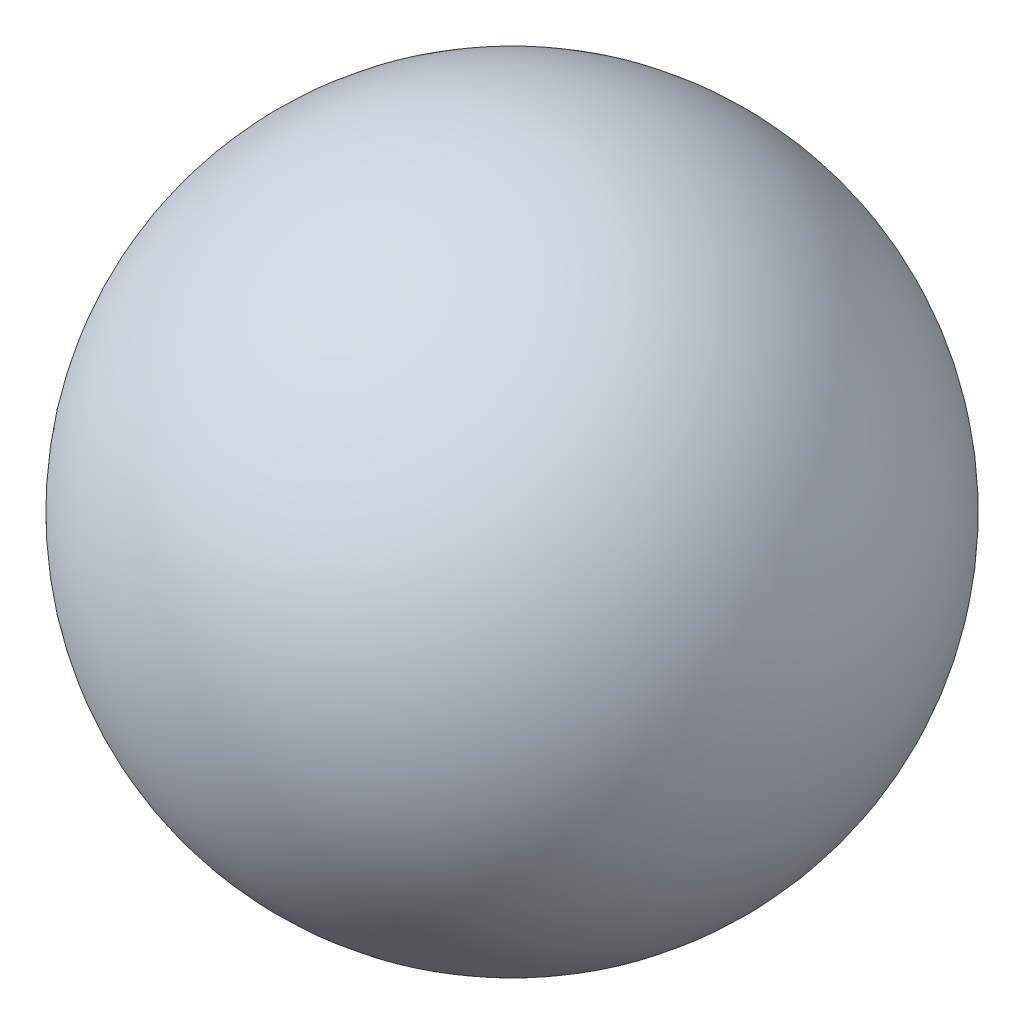
ISO-10303-21;
HEADER;
FILE_DESCRIPTION(('STEP AP214'),'2;1');
FILE_NAME('part.step','',(''),(''),'','','');
FILE_SCHEMA(('AUTOMOTIVE_DESIGN { 1 0 10303 214 1 1 1 1 }'));
ENDSEC;
DATA;
#1=APPLICATION_CONTEXT('core data for automotive mechanical design processes');
#2=APPLICATION_PROTOCOL_DEFINITION('international standard','automotive_design',2000,#1);
#3=PRODUCT_CONTEXT('',#1,'mechanical');
#4=PRODUCT('Part','Part','',(#3));
#5=PRODUCT_RELATED_PRODUCT_CATEGORY('part','',(#4));
#6=PRODUCT_DEFINITION_FORMATION('','',#4);
#7=PRODUCT_DEFINITION_CONTEXT('part definition',#1,'design');
#8=PRODUCT_DEFINITION('design','',#6,#7);
#9=PRODUCT_DEFINITION_SHAPE('','',#8);
#10=(LENGTH_UNIT() NAMED_UNIT(*) SI_UNIT(.MILLI.,.METRE.));
#11=(NAMED_UNIT(*) PLANE_ANGLE_UNIT() SI_UNIT($,.RADIAN.));
#12=(NAMED_UNIT(*) SI_UNIT($,.STERADIAN.) SOLID_ANGLE_UNIT());
#13=UNCERTAINTY_MEASURE_WITH_UNIT(LENGTH_MEASURE(1.E-05),#10,'distance_accuracy_value','');
#14=(GEOMETRIC_REPRESENTATION_CONTEXT(3) GLOBAL_UNCERTAINTY_ASSIGNED_CONTEXT((#13)) GLOBAL_UNIT_ASSIGNED_CONTEXT((#10,
#11,#12)) REPRESENTATION_CONTEXT('',''));
#15=CARTESIAN_POINT('',(0.,0.,0.));
#16=DIRECTION('',(0.,0.,1.));
#17=DIRECTION('',(1.,0.,0.));
#18=AXIS2_PLACEMENT_3D('',#15,#16,#17);
#19=CARTESIAN_POINT('',(0.,127.,0.));
#20=DIRECTION('',(0.,1.,0.));
#21=DIRECTION('',(1.,0.,0.));
#22=AXIS2_PLACEMENT_3D('',#19,#20,#21);
#23=SPHERICAL_SURFACE('',#22,127.);
#24=CARTESIAN_POINT('',(0.,254.,0.));
#25=VERTEX_POINT('',#24);
#26=VERTEX_LOOP('',#25);
#27=FACE_BOUND('',#26,.T.);
#28=ADVANCED_FACE('F29',(#27),#23,.T.);
#29=CLOSED_SHELL('',(#28));
#30=MANIFOLD_SOLID_BREP('B2',#29);
#31=ADVANCED_BREP_SHAPE_REPRESENTATION('',(#18,#30),#14);
#32=SHAPE_DEFINITION_REPRESENTATION(#9,#31);
ENDSEC;
END-ISO-10303-21;
